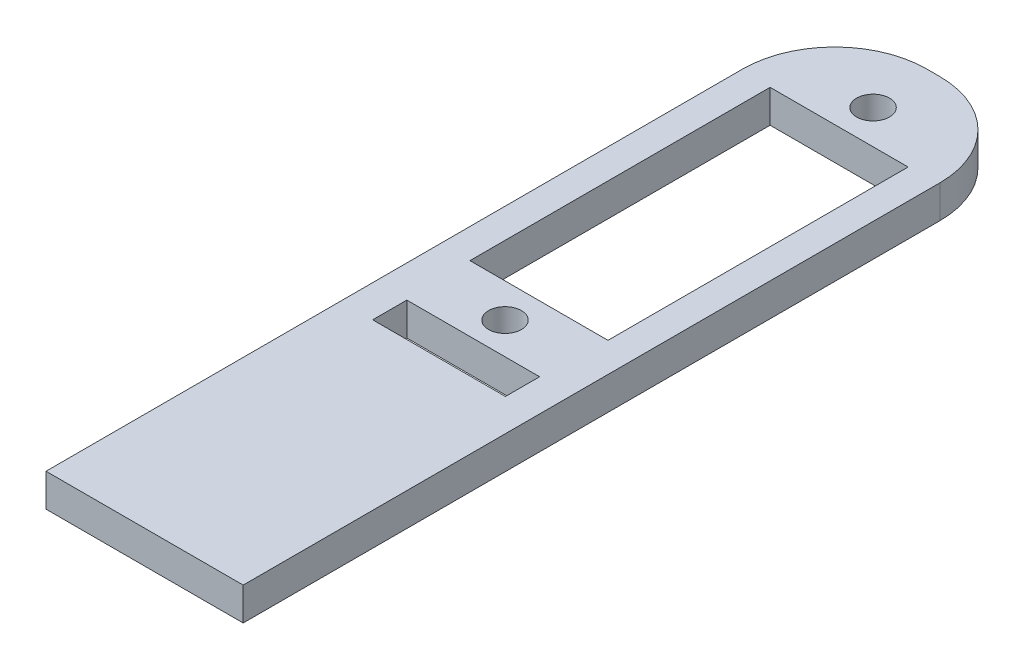
ISO-10303-21;
HEADER;
FILE_DESCRIPTION(('STEP AP214'),'2;1');
FILE_NAME('part.step','',(''),(''),'','','');
FILE_SCHEMA(('AUTOMOTIVE_DESIGN { 1 0 10303 214 1 1 1 1 }'));
ENDSEC;
DATA;
#1=APPLICATION_CONTEXT('core data for automotive mechanical design processes');
#2=APPLICATION_PROTOCOL_DEFINITION('international standard','automotive_design',2000,#1);
#3=PRODUCT_CONTEXT('',#1,'mechanical');
#4=PRODUCT('Part','Part','',(#3));
#5=PRODUCT_RELATED_PRODUCT_CATEGORY('part','',(#4));
#6=PRODUCT_DEFINITION_FORMATION('','',#4);
#7=PRODUCT_DEFINITION_CONTEXT('part definition',#1,'design');
#8=PRODUCT_DEFINITION('design','',#6,#7);
#9=PRODUCT_DEFINITION_SHAPE('','',#8);
#10=(LENGTH_UNIT() NAMED_UNIT(*) SI_UNIT(.MILLI.,.METRE.));
#11=(NAMED_UNIT(*) PLANE_ANGLE_UNIT() SI_UNIT($,.RADIAN.));
#12=(NAMED_UNIT(*) SI_UNIT($,.STERADIAN.) SOLID_ANGLE_UNIT());
#13=UNCERTAINTY_MEASURE_WITH_UNIT(LENGTH_MEASURE(1.E-05),#10,'distance_accuracy_value','');
#14=(GEOMETRIC_REPRESENTATION_CONTEXT(3) GLOBAL_UNCERTAINTY_ASSIGNED_CONTEXT((#13)) GLOBAL_UNIT_ASSIGNED_CONTEXT((#10,
#11,#12)) REPRESENTATION_CONTEXT('',''));
#15=CARTESIAN_POINT('',(0.,0.,0.));
#16=DIRECTION('',(0.,0.,1.));
#17=DIRECTION('',(1.,0.,0.));
#18=AXIS2_PLACEMENT_3D('',#15,#16,#17);
#19=CARTESIAN_POINT('',(-0.635,3.175,-29.21));
#20=DIRECTION('',(0.,1.,0.));
#21=DIRECTION('',(0.,0.,1.));
#22=AXIS2_PLACEMENT_3D('',#19,#20,#21);
#23=CYLINDRICAL_SURFACE('',#22,8.89);
#24=DIRECTION('',(0.,1.,0.));
#25=VECTOR('',#24,1.);
#26=CARTESIAN_POINT('',(-0.635,3.175,-38.1));
#27=LINE('',#26,#25);
#28=CARTESIAN_POINT('',(-0.635000000000004,0.,-38.1));
#29=VERTEX_POINT('',#28);
#30=CARTESIAN_POINT('',(-0.635000000000004,3.175,-38.1));
#31=VERTEX_POINT('',#30);
#32=EDGE_CURVE('E249',#29,#31,#27,.T.);
#33=ORIENTED_EDGE('',*,*,#32,.F.);
#34=CARTESIAN_POINT('',(-0.635,0.,-29.21));
#35=DIRECTION('',(0.,1.,0.));
#36=DIRECTION('',(0.,0.,1.));
#37=AXIS2_PLACEMENT_3D('',#34,#35,#36);
#38=CIRCLE('',#37,8.89);
#39=CARTESIAN_POINT('',(-9.525,0.,-29.21));
#40=VERTEX_POINT('',#39);
#41=EDGE_CURVE('E39',#40,#29,#38,.F.);
#42=ORIENTED_EDGE('',*,*,#41,.F.);
#43=DIRECTION('',(0.,1.,0.));
#44=VECTOR('',#43,1.);
#45=CARTESIAN_POINT('',(-9.525,3.175,-29.21));
#46=LINE('',#45,#44);
#47=CARTESIAN_POINT('',(-9.525,3.175,-29.21));
#48=VERTEX_POINT('',#47);
#49=EDGE_CURVE('E252',#48,#40,#46,.F.);
#50=ORIENTED_EDGE('',*,*,#49,.F.);
#51=CARTESIAN_POINT('',(-0.635,3.175,-29.21));
#52=DIRECTION('',(0.,1.,0.));
#53=DIRECTION('',(0.,0.,1.));
#54=AXIS2_PLACEMENT_3D('',#51,#52,#53);
#55=CIRCLE('',#54,8.89);
#56=EDGE_CURVE('E11',#31,#48,#55,.T.);
#57=ORIENTED_EDGE('',*,*,#56,.F.);
#58=EDGE_LOOP('',(#33,#42,#50,#57));
#59=FACE_BOUND('',#58,.T.);
#60=ADVANCED_FACE('F32',(#59),#23,.T.);
#61=CARTESIAN_POINT('',(0.635000000000004,3.175,-29.21));
#62=DIRECTION('',(0.,-1.,0.));
#63=DIRECTION('',(0.,0.,-1.));
#64=AXIS2_PLACEMENT_3D('',#61,#62,#63);
#65=CYLINDRICAL_SURFACE('',#64,8.89);
#66=DIRECTION('',(0.,-1.,0.));
#67=VECTOR('',#66,1.);
#68=CARTESIAN_POINT('',(0.635000000000004,3.175,-38.1));
#69=LINE('',#68,#67);
#70=CARTESIAN_POINT('',(0.635,3.175,-38.1));
#71=VERTEX_POINT('',#70);
#72=CARTESIAN_POINT('',(0.635,0.,-38.1));
#73=VERTEX_POINT('',#72);
#74=EDGE_CURVE('E239',#71,#73,#69,.T.);
#75=ORIENTED_EDGE('',*,*,#74,.F.);
#76=CARTESIAN_POINT('',(0.635000000000004,3.175,-29.21));
#77=DIRECTION('',(0.,1.,0.));
#78=DIRECTION('',(0.,0.,1.));
#79=AXIS2_PLACEMENT_3D('',#76,#77,#78);
#80=CIRCLE('',#79,8.89);
#81=CARTESIAN_POINT('',(9.525,3.175,-29.21));
#82=VERTEX_POINT('',#81);
#83=EDGE_CURVE('E245',#82,#71,#80,.T.);
#84=ORIENTED_EDGE('',*,*,#83,.F.);
#85=DIRECTION('',(0.,-1.,0.));
#86=VECTOR('',#85,1.);
#87=CARTESIAN_POINT('',(9.525,3.175,-29.21));
#88=LINE('',#87,#86);
#89=CARTESIAN_POINT('',(9.525,0.,-29.21));
#90=VERTEX_POINT('',#89);
#91=EDGE_CURVE('E242',#90,#82,#88,.F.);
#92=ORIENTED_EDGE('',*,*,#91,.F.);
#93=CARTESIAN_POINT('',(0.635000000000004,0.,-29.21));
#94=DIRECTION('',(0.,1.,0.));
#95=DIRECTION('',(0.,0.,1.));
#96=AXIS2_PLACEMENT_3D('',#93,#94,#95);
#97=CIRCLE('',#96,8.89);
#98=EDGE_CURVE('E247',#73,#90,#97,.F.);
#99=ORIENTED_EDGE('',*,*,#98,.F.);
#100=EDGE_LOOP('',(#75,#84,#92,#99));
#101=FACE_BOUND('',#100,.T.);
#102=ADVANCED_FACE('F264',(#101),#65,.T.);
#103=CARTESIAN_POINT('',(0.,3.175,0.));
#104=DIRECTION('',(0.,1.,0.));
#105=DIRECTION('',(0.,0.,1.));
#106=AXIS2_PLACEMENT_3D('',#103,#104,#105);
#107=PLANE('',#106);
#108=CARTESIAN_POINT('',(0.,3.175,3.28));
#109=DIRECTION('',(0.,1.,0.));
#110=DIRECTION('',(0.,0.,-1.));
#111=AXIS2_PLACEMENT_3D('',#108,#109,#110);
#112=CIRCLE('',#111,1.5875);
#113=CARTESIAN_POINT('',(0.,3.175,1.6925));
#114=VERTEX_POINT('',#113);
#115=EDGE_CURVE('E172',#114,#114,#112,.T.);
#116=ORIENTED_EDGE('',*,*,#115,.F.);
#117=EDGE_LOOP('',(#116));
#118=FACE_BOUND('',#117,.T.);
#119=DIRECTION('',(1.,0.,0.));
#120=VECTOR('',#119,1.);
#121=CARTESIAN_POINT('',(-6.6675,3.175,0.));
#122=LINE('',#121,#120);
#123=CARTESIAN_POINT('',(-6.6675,3.175,0.));
#124=VERTEX_POINT('',#123);
#125=CARTESIAN_POINT('',(6.6675,3.175,0.));
#126=VERTEX_POINT('',#125);
#127=EDGE_CURVE('E186',#124,#126,#122,.T.);
#128=ORIENTED_EDGE('',*,*,#127,.F.);
#129=DIRECTION('',(0.,0.,1.));
#130=VECTOR('',#129,1.);
#131=CARTESIAN_POINT('',(-6.6675,3.175,-29.));
#132=LINE('',#131,#130);
#133=CARTESIAN_POINT('',(-6.6675,3.175,-29.));
#134=VERTEX_POINT('',#133);
#135=EDGE_CURVE('E184',#134,#124,#132,.T.);
#136=ORIENTED_EDGE('',*,*,#135,.F.);
#137=DIRECTION('',(-1.,0.,0.));
#138=VECTOR('',#137,1.);
#139=CARTESIAN_POINT('',(-6.6675,3.175,-29.));
#140=LINE('',#139,#138);
#141=CARTESIAN_POINT('',(6.6675,3.175,-29.));
#142=VERTEX_POINT('',#141);
#143=EDGE_CURVE('E192',#142,#134,#140,.T.);
#144=ORIENTED_EDGE('',*,*,#143,.F.);
#145=DIRECTION('',(0.,0.,-1.));
#146=VECTOR('',#145,1.);
#147=CARTESIAN_POINT('',(6.6675,3.175,-29.));
#148=LINE('',#147,#146);
#149=EDGE_CURVE('E189',#126,#142,#148,.T.);
#150=ORIENTED_EDGE('',*,*,#149,.F.);
#151=EDGE_LOOP('',(#128,#136,#144,#150));
#152=FACE_BOUND('',#151,.T.);
#153=DIRECTION('',(-1.,0.,0.));
#154=VECTOR('',#153,1.);
#155=CARTESIAN_POINT('',(-9.525,3.175,-38.1));
#156=LINE('',#155,#154);
#157=EDGE_CURVE('E223',#71,#31,#156,.T.);
#158=ORIENTED_EDGE('',*,*,#157,.T.);
#159=ORIENTED_EDGE('',*,*,#56,.T.);
#160=DIRECTION('',(0.,0.,1.));
#161=VECTOR('',#160,1.);
#162=CARTESIAN_POINT('',(-9.525,3.175,-38.1));
#163=LINE('',#162,#161);
#164=CARTESIAN_POINT('',(-9.525,3.175,38.1));
#165=VERTEX_POINT('',#164);
#166=EDGE_CURVE('E215',#48,#165,#163,.T.);
#167=ORIENTED_EDGE('',*,*,#166,.T.);
#168=DIRECTION('',(1.,0.,0.));
#169=VECTOR('',#168,1.);
#170=CARTESIAN_POINT('',(-9.525,3.175,38.1));
#171=LINE('',#170,#169);
#172=CARTESIAN_POINT('',(9.52500000000001,3.175,38.1));
#173=VERTEX_POINT('',#172);
#174=EDGE_CURVE('E217',#165,#173,#171,.T.);
#175=ORIENTED_EDGE('',*,*,#174,.T.);
#176=DIRECTION('',(0.,0.,-1.));
#177=VECTOR('',#176,1.);
#178=CARTESIAN_POINT('',(9.525,3.175,-38.1));
#179=LINE('',#178,#177);
#180=EDGE_CURVE('E220',#173,#82,#179,.T.);
#181=ORIENTED_EDGE('',*,*,#180,.T.);
#182=ORIENTED_EDGE('',*,*,#83,.T.);
#183=EDGE_LOOP('',(#158,#159,#167,#175,#181,#182));
#184=FACE_BOUND('',#183,.T.);
#185=CARTESIAN_POINT('',(0.,3.175,-32.28));
#186=DIRECTION('',(0.,1.,0.));
#187=DIRECTION('',(0.,0.,1.));
#188=AXIS2_PLACEMENT_3D('',#185,#186,#187);
#189=CIRCLE('',#188,1.5875);
#190=CARTESIAN_POINT('',(0.,3.175,-30.6925));
#191=VERTEX_POINT('',#190);
#192=EDGE_CURVE('E178',#191,#191,#189,.T.);
#193=ORIENTED_EDGE('',*,*,#192,.F.);
#194=EDGE_LOOP('',(#193));
#195=FACE_BOUND('',#194,.T.);
#196=DIRECTION('',(1.,0.,0.));
#197=VECTOR('',#196,1.);
#198=CARTESIAN_POINT('',(-6.41350000000001,3.175,9.652));
#199=LINE('',#198,#197);
#200=CARTESIAN_POINT('',(-6.41350000000001,3.175,9.652));
#201=VERTEX_POINT('',#200);
#202=CARTESIAN_POINT('',(6.41349999999999,3.175,9.652));
#203=VERTEX_POINT('',#202);
#204=EDGE_CURVE('E140',#201,#203,#199,.T.);
#205=ORIENTED_EDGE('',*,*,#204,.F.);
#206=DIRECTION('',(0.,0.,1.));
#207=VECTOR('',#206,1.);
#208=CARTESIAN_POINT('',(-6.41349999999999,3.175,6.35));
#209=LINE('',#208,#207);
#210=CARTESIAN_POINT('',(-6.41349999999999,3.175,6.35));
#211=VERTEX_POINT('',#210);
#212=EDGE_CURVE('E130',#211,#201,#209,.T.);
#213=ORIENTED_EDGE('',*,*,#212,.F.);
#214=DIRECTION('',(-1.,0.,0.));
#215=VECTOR('',#214,1.);
#216=CARTESIAN_POINT('',(-6.41349999999999,3.175,6.35));
#217=LINE('',#216,#215);
#218=CARTESIAN_POINT('',(6.41349999999999,3.175,6.35));
#219=VERTEX_POINT('',#218);
#220=EDGE_CURVE('E156',#219,#211,#217,.T.);
#221=ORIENTED_EDGE('',*,*,#220,.F.);
#222=DIRECTION('',(0.,0.,-1.));
#223=VECTOR('',#222,1.);
#224=CARTESIAN_POINT('',(6.41349999999999,3.175,6.35));
#225=LINE('',#224,#223);
#226=EDGE_CURVE('E154',#203,#219,#225,.T.);
#227=ORIENTED_EDGE('',*,*,#226,.F.);
#228=EDGE_LOOP('',(#205,#213,#221,#227));
#229=FACE_BOUND('',#228,.T.);
#230=ADVANCED_FACE('F152',(#118,#152,#184,#195,#229),#107,.T.);
#231=CARTESIAN_POINT('',(0.,0.,0.));
#232=DIRECTION('',(0.,1.,0.));
#233=DIRECTION('',(0.,0.,1.));
#234=AXIS2_PLACEMENT_3D('',#231,#232,#233);
#235=PLANE('',#234);
#236=CARTESIAN_POINT('',(0.,0.,3.28));
#237=DIRECTION('',(0.,1.,0.));
#238=DIRECTION('',(0.,0.,-1.));
#239=AXIS2_PLACEMENT_3D('',#236,#237,#238);
#240=CIRCLE('',#239,1.5875);
#241=CARTESIAN_POINT('',(0.,0.,1.6925));
#242=VERTEX_POINT('',#241);
#243=EDGE_CURVE('E148',#242,#242,#240,.T.);
#244=ORIENTED_EDGE('',*,*,#243,.T.);
#245=EDGE_LOOP('',(#244));
#246=FACE_BOUND('',#245,.T.);
#247=DIRECTION('',(0.,0.,1.));
#248=VECTOR('',#247,1.);
#249=CARTESIAN_POINT('',(-6.6675,0.,-29.));
#250=LINE('',#249,#248);
#251=CARTESIAN_POINT('',(-6.6675,0.,-29.));
#252=VERTEX_POINT('',#251);
#253=CARTESIAN_POINT('',(-6.6675,0.,0.));
#254=VERTEX_POINT('',#253);
#255=EDGE_CURVE('E181',#252,#254,#250,.T.);
#256=ORIENTED_EDGE('',*,*,#255,.T.);
#257=DIRECTION('',(1.,0.,0.));
#258=VECTOR('',#257,1.);
#259=CARTESIAN_POINT('',(-6.6675,0.,0.));
#260=LINE('',#259,#258);
#261=CARTESIAN_POINT('',(6.6675,0.,0.));
#262=VERTEX_POINT('',#261);
#263=EDGE_CURVE('E197',#254,#262,#260,.T.);
#264=ORIENTED_EDGE('',*,*,#263,.T.);
#265=DIRECTION('',(0.,0.,-1.));
#266=VECTOR('',#265,1.);
#267=CARTESIAN_POINT('',(6.6675,0.,-29.));
#268=LINE('',#267,#266);
#269=CARTESIAN_POINT('',(6.6675,0.,-29.));
#270=VERTEX_POINT('',#269);
#271=EDGE_CURVE('E200',#262,#270,#268,.T.);
#272=ORIENTED_EDGE('',*,*,#271,.T.);
#273=DIRECTION('',(-1.,0.,0.));
#274=VECTOR('',#273,1.);
#275=CARTESIAN_POINT('',(-6.6675,0.,-29.));
#276=LINE('',#275,#274);
#277=EDGE_CURVE('E187',#270,#252,#276,.T.);
#278=ORIENTED_EDGE('',*,*,#277,.T.);
#279=EDGE_LOOP('',(#256,#264,#272,#278));
#280=FACE_BOUND('',#279,.T.);
#281=DIRECTION('',(0.,0.,1.));
#282=VECTOR('',#281,1.);
#283=CARTESIAN_POINT('',(-9.525,0.,-38.1));
#284=LINE('',#283,#282);
#285=CARTESIAN_POINT('',(-9.525,0.,38.1));
#286=VERTEX_POINT('',#285);
#287=EDGE_CURVE('E214',#40,#286,#284,.T.);
#288=ORIENTED_EDGE('',*,*,#287,.F.);
#289=ORIENTED_EDGE('',*,*,#41,.T.);
#290=DIRECTION('',(-1.,0.,0.));
#291=VECTOR('',#290,1.);
#292=CARTESIAN_POINT('',(-9.525,0.,-38.1));
#293=LINE('',#292,#291);
#294=EDGE_CURVE('E218',#73,#29,#293,.T.);
#295=ORIENTED_EDGE('',*,*,#294,.F.);
#296=ORIENTED_EDGE('',*,*,#98,.T.);
#297=DIRECTION('',(0.,0.,-1.));
#298=VECTOR('',#297,1.);
#299=CARTESIAN_POINT('',(9.525,0.,-38.1));
#300=LINE('',#299,#298);
#301=CARTESIAN_POINT('',(9.52500000000001,0.,38.1));
#302=VERTEX_POINT('',#301);
#303=EDGE_CURVE('E229',#302,#90,#300,.T.);
#304=ORIENTED_EDGE('',*,*,#303,.F.);
#305=DIRECTION('',(1.,0.,0.));
#306=VECTOR('',#305,1.);
#307=CARTESIAN_POINT('',(-9.525,0.,38.1));
#308=LINE('',#307,#306);
#309=EDGE_CURVE('E227',#286,#302,#308,.T.);
#310=ORIENTED_EDGE('',*,*,#309,.F.);
#311=EDGE_LOOP('',(#288,#289,#295,#296,#304,#310));
#312=FACE_BOUND('',#311,.T.);
#313=CARTESIAN_POINT('',(0.,0.,-32.28));
#314=DIRECTION('',(0.,1.,0.));
#315=DIRECTION('',(0.,0.,1.));
#316=AXIS2_PLACEMENT_3D('',#313,#314,#315);
#317=CIRCLE('',#316,1.5875);
#318=CARTESIAN_POINT('',(0.,0.,-30.6925));
#319=VERTEX_POINT('',#318);
#320=EDGE_CURVE('E175',#319,#319,#317,.T.);
#321=ORIENTED_EDGE('',*,*,#320,.T.);
#322=EDGE_LOOP('',(#321));
#323=FACE_BOUND('',#322,.T.);
#324=DIRECTION('',(0.,0.,1.));
#325=VECTOR('',#324,1.);
#326=CARTESIAN_POINT('',(-6.41349999999999,0.,6.35));
#327=LINE('',#326,#325);
#328=CARTESIAN_POINT('',(-6.41349999999999,0.,6.35));
#329=VERTEX_POINT('',#328);
#330=CARTESIAN_POINT('',(-6.41350000000001,0.,9.652));
#331=VERTEX_POINT('',#330);
#332=EDGE_CURVE('E160',#329,#331,#327,.T.);
#333=ORIENTED_EDGE('',*,*,#332,.T.);
#334=DIRECTION('',(1.,0.,0.));
#335=VECTOR('',#334,1.);
#336=CARTESIAN_POINT('',(-6.41350000000001,0.,9.652));
#337=LINE('',#336,#335);
#338=CARTESIAN_POINT('',(6.41349999999999,0.,9.652));
#339=VERTEX_POINT('',#338);
#340=EDGE_CURVE('E147',#331,#339,#337,.T.);
#341=ORIENTED_EDGE('',*,*,#340,.T.);
#342=DIRECTION('',(0.,0.,-1.));
#343=VECTOR('',#342,1.);
#344=CARTESIAN_POINT('',(6.41349999999999,0.,6.35));
#345=LINE('',#344,#343);
#346=CARTESIAN_POINT('',(6.41349999999999,0.,6.35));
#347=VERTEX_POINT('',#346);
#348=EDGE_CURVE('E163',#339,#347,#345,.T.);
#349=ORIENTED_EDGE('',*,*,#348,.T.);
#350=DIRECTION('',(-1.,0.,0.));
#351=VECTOR('',#350,1.);
#352=CARTESIAN_POINT('',(-6.41349999999999,0.,6.35));
#353=LINE('',#352,#351);
#354=EDGE_CURVE('E141',#347,#329,#353,.T.);
#355=ORIENTED_EDGE('',*,*,#354,.T.);
#356=EDGE_LOOP('',(#333,#341,#349,#355));
#357=FACE_BOUND('',#356,.T.);
#358=ADVANCED_FACE('F256',(#246,#280,#312,#323,#357),#235,.F.);
#359=CARTESIAN_POINT('',(-9.525,3.175,-38.1));
#360=DIRECTION('',(1.,0.,0.));
#361=DIRECTION('',(0.,0.,-1.));
#362=AXIS2_PLACEMENT_3D('',#359,#360,#361);
#363=PLANE('',#362);
#364=ORIENTED_EDGE('',*,*,#166,.F.);
#365=ORIENTED_EDGE('',*,*,#49,.T.);
#366=ORIENTED_EDGE('',*,*,#287,.T.);
#367=DIRECTION('',(0.,-1.,0.));
#368=VECTOR('',#367,1.);
#369=CARTESIAN_POINT('',(-9.525,3.175,38.1));
#370=LINE('',#369,#368);
#371=EDGE_CURVE('E236',#165,#286,#370,.T.);
#372=ORIENTED_EDGE('',*,*,#371,.F.);
#373=EDGE_LOOP('',(#364,#365,#366,#372));
#374=FACE_BOUND('',#373,.T.);
#375=ADVANCED_FACE('F277',(#374),#363,.F.);
#376=CARTESIAN_POINT('',(-9.525,3.175,38.1));
#377=DIRECTION('',(0.,0.,-1.));
#378=DIRECTION('',(-1.,0.,0.));
#379=AXIS2_PLACEMENT_3D('',#376,#377,#378);
#380=PLANE('',#379);
#381=ORIENTED_EDGE('',*,*,#309,.T.);
#382=DIRECTION('',(0.,-1.,0.));
#383=VECTOR('',#382,1.);
#384=CARTESIAN_POINT('',(9.52500000000001,3.175,38.1));
#385=LINE('',#384,#383);
#386=EDGE_CURVE('E225',#173,#302,#385,.T.);
#387=ORIENTED_EDGE('',*,*,#386,.F.);
#388=ORIENTED_EDGE('',*,*,#174,.F.);
#389=ORIENTED_EDGE('',*,*,#371,.T.);
#390=EDGE_LOOP('',(#381,#387,#388,#389));
#391=FACE_BOUND('',#390,.T.);
#392=ADVANCED_FACE('F273',(#391),#380,.F.);
#393=CARTESIAN_POINT('',(9.525,3.175,-38.1));
#394=DIRECTION('',(-1.,0.,0.));
#395=DIRECTION('',(0.,0.,1.));
#396=AXIS2_PLACEMENT_3D('',#393,#394,#395);
#397=PLANE('',#396);
#398=ORIENTED_EDGE('',*,*,#303,.T.);
#399=ORIENTED_EDGE('',*,*,#91,.T.);
#400=ORIENTED_EDGE('',*,*,#180,.F.);
#401=ORIENTED_EDGE('',*,*,#386,.T.);
#402=EDGE_LOOP('',(#398,#399,#400,#401));
#403=FACE_BOUND('',#402,.T.);
#404=ADVANCED_FACE('F268',(#403),#397,.F.);
#405=CARTESIAN_POINT('',(-9.525,3.175,-38.1));
#406=DIRECTION('',(0.,0.,1.));
#407=DIRECTION('',(1.,0.,0.));
#408=AXIS2_PLACEMENT_3D('',#405,#406,#407);
#409=PLANE('',#408);
#410=ORIENTED_EDGE('',*,*,#294,.T.);
#411=ORIENTED_EDGE('',*,*,#32,.T.);
#412=ORIENTED_EDGE('',*,*,#157,.F.);
#413=ORIENTED_EDGE('',*,*,#74,.T.);
#414=EDGE_LOOP('',(#410,#411,#412,#413));
#415=FACE_BOUND('',#414,.T.);
#416=ADVANCED_FACE('F261',(#415),#409,.F.);
#417=CARTESIAN_POINT('',(-6.6675,3.175,-29.));
#418=DIRECTION('',(1.,0.,0.));
#419=DIRECTION('',(0.,0.,-1.));
#420=AXIS2_PLACEMENT_3D('',#417,#418,#419);
#421=PLANE('',#420);
#422=ORIENTED_EDGE('',*,*,#255,.F.);
#423=DIRECTION('',(0.,-1.,0.));
#424=VECTOR('',#423,1.);
#425=CARTESIAN_POINT('',(-6.6675,3.175,-29.));
#426=LINE('',#425,#424);
#427=EDGE_CURVE('E194',#134,#252,#426,.T.);
#428=ORIENTED_EDGE('',*,*,#427,.F.);
#429=ORIENTED_EDGE('',*,*,#135,.T.);
#430=DIRECTION('',(0.,-1.,0.));
#431=VECTOR('',#430,1.);
#432=CARTESIAN_POINT('',(-6.6675,3.175,0.));
#433=LINE('',#432,#431);
#434=EDGE_CURVE('E211',#124,#254,#433,.T.);
#435=ORIENTED_EDGE('',*,*,#434,.T.);
#436=EDGE_LOOP('',(#422,#428,#429,#435));
#437=FACE_BOUND('',#436,.T.);
#438=ADVANCED_FACE('F323',(#437),#421,.T.);
#439=CARTESIAN_POINT('',(-6.6675,3.175,0.));
#440=DIRECTION('',(0.,0.,-1.));
#441=DIRECTION('',(-1.,0.,0.));
#442=AXIS2_PLACEMENT_3D('',#439,#440,#441);
#443=PLANE('',#442);
#444=ORIENTED_EDGE('',*,*,#263,.F.);
#445=ORIENTED_EDGE('',*,*,#434,.F.);
#446=ORIENTED_EDGE('',*,*,#127,.T.);
#447=DIRECTION('',(0.,-1.,0.));
#448=VECTOR('',#447,1.);
#449=CARTESIAN_POINT('',(6.6675,3.175,0.));
#450=LINE('',#449,#448);
#451=EDGE_CURVE('E209',#126,#262,#450,.T.);
#452=ORIENTED_EDGE('',*,*,#451,.T.);
#453=EDGE_LOOP('',(#444,#445,#446,#452));
#454=FACE_BOUND('',#453,.T.);
#455=ADVANCED_FACE('F327',(#454),#443,.T.);
#456=CARTESIAN_POINT('',(6.6675,3.175,-29.));
#457=DIRECTION('',(-1.,0.,0.));
#458=DIRECTION('',(0.,0.,1.));
#459=AXIS2_PLACEMENT_3D('',#456,#457,#458);
#460=PLANE('',#459);
#461=ORIENTED_EDGE('',*,*,#271,.F.);
#462=ORIENTED_EDGE('',*,*,#451,.F.);
#463=ORIENTED_EDGE('',*,*,#149,.T.);
#464=DIRECTION('',(0.,-1.,0.));
#465=VECTOR('',#464,1.);
#466=CARTESIAN_POINT('',(6.6675,3.175,-29.));
#467=LINE('',#466,#465);
#468=EDGE_CURVE('E207',#142,#270,#467,.T.);
#469=ORIENTED_EDGE('',*,*,#468,.T.);
#470=EDGE_LOOP('',(#461,#462,#463,#469));
#471=FACE_BOUND('',#470,.T.);
#472=ADVANCED_FACE('F331',(#471),#460,.T.);
#473=CARTESIAN_POINT('',(-6.6675,3.175,-29.));
#474=DIRECTION('',(0.,0.,1.));
#475=DIRECTION('',(1.,0.,0.));
#476=AXIS2_PLACEMENT_3D('',#473,#474,#475);
#477=PLANE('',#476);
#478=ORIENTED_EDGE('',*,*,#277,.F.);
#479=ORIENTED_EDGE('',*,*,#468,.F.);
#480=ORIENTED_EDGE('',*,*,#143,.T.);
#481=ORIENTED_EDGE('',*,*,#427,.T.);
#482=EDGE_LOOP('',(#478,#479,#480,#481));
#483=FACE_BOUND('',#482,.T.);
#484=ADVANCED_FACE('F288',(#483),#477,.T.);
#485=CARTESIAN_POINT('',(0.,3.175,-32.28));
#486=DIRECTION('',(0.,-1.,0.));
#487=DIRECTION('',(0.,0.,-1.));
#488=AXIS2_PLACEMENT_3D('',#485,#486,#487);
#489=CYLINDRICAL_SURFACE('',#488,1.5875);
#490=ORIENTED_EDGE('',*,*,#192,.T.);
#491=EDGE_LOOP('',(#490));
#492=FACE_BOUND('',#491,.T.);
#493=ORIENTED_EDGE('',*,*,#320,.F.);
#494=EDGE_LOOP('',(#493));
#495=FACE_BOUND('',#494,.T.);
#496=ADVANCED_FACE('F284',(#492,#495),#489,.F.);
#497=CARTESIAN_POINT('',(0.,3.175,3.28));
#498=DIRECTION('',(0.,-1.,0.));
#499=DIRECTION('',(0.,0.,-1.));
#500=AXIS2_PLACEMENT_3D('',#497,#498,#499);
#501=CYLINDRICAL_SURFACE('',#500,1.5875);
#502=ORIENTED_EDGE('',*,*,#115,.T.);
#503=EDGE_LOOP('',(#502));
#504=FACE_BOUND('',#503,.T.);
#505=ORIENTED_EDGE('',*,*,#243,.F.);
#506=EDGE_LOOP('',(#505));
#507=FACE_BOUND('',#506,.T.);
#508=ADVANCED_FACE('F287',(#504,#507),#501,.F.);
#509=CARTESIAN_POINT('',(-6.41349999999999,3.175,6.35));
#510=DIRECTION('',(1.,0.,0.));
#511=DIRECTION('',(0.,0.,-1.));
#512=AXIS2_PLACEMENT_3D('',#509,#510,#511);
#513=PLANE('',#512);
#514=ORIENTED_EDGE('',*,*,#332,.F.);
#515=DIRECTION('',(0.,-1.,0.));
#516=VECTOR('',#515,1.);
#517=CARTESIAN_POINT('',(-6.41349999999999,3.175,6.35));
#518=LINE('',#517,#516);
#519=EDGE_CURVE('E136',#211,#329,#518,.T.);
#520=ORIENTED_EDGE('',*,*,#519,.F.);
#521=ORIENTED_EDGE('',*,*,#212,.T.);
#522=DIRECTION('',(0.,-1.,0.));
#523=VECTOR('',#522,1.);
#524=CARTESIAN_POINT('',(-6.41350000000001,3.175,9.652));
#525=LINE('',#524,#523);
#526=EDGE_CURVE('E133',#201,#331,#525,.T.);
#527=ORIENTED_EDGE('',*,*,#526,.T.);
#528=EDGE_LOOP('',(#514,#520,#521,#527));
#529=FACE_BOUND('',#528,.T.);
#530=ADVANCED_FACE('F132',(#529),#513,.T.);
#531=CARTESIAN_POINT('',(-6.41350000000001,3.175,9.652));
#532=DIRECTION('',(0.,0.,-1.));
#533=DIRECTION('',(-1.,0.,0.));
#534=AXIS2_PLACEMENT_3D('',#531,#532,#533);
#535=PLANE('',#534);
#536=ORIENTED_EDGE('',*,*,#340,.F.);
#537=ORIENTED_EDGE('',*,*,#526,.F.);
#538=ORIENTED_EDGE('',*,*,#204,.T.);
#539=DIRECTION('',(0.,-1.,0.));
#540=VECTOR('',#539,1.);
#541=CARTESIAN_POINT('',(6.41349999999999,3.175,9.652));
#542=LINE('',#541,#540);
#543=EDGE_CURVE('E149',#203,#339,#542,.T.);
#544=ORIENTED_EDGE('',*,*,#543,.T.);
#545=EDGE_LOOP('',(#536,#537,#538,#544));
#546=FACE_BOUND('',#545,.T.);
#547=ADVANCED_FACE('F144',(#546),#535,.T.);
#548=CARTESIAN_POINT('',(6.41349999999999,3.175,6.35));
#549=DIRECTION('',(-1.,0.,0.));
#550=DIRECTION('',(0.,0.,1.));
#551=AXIS2_PLACEMENT_3D('',#548,#549,#550);
#552=PLANE('',#551);
#553=ORIENTED_EDGE('',*,*,#348,.F.);
#554=ORIENTED_EDGE('',*,*,#543,.F.);
#555=ORIENTED_EDGE('',*,*,#226,.T.);
#556=DIRECTION('',(0.,-1.,0.));
#557=VECTOR('',#556,1.);
#558=CARTESIAN_POINT('',(6.41349999999999,3.175,6.35));
#559=LINE('',#558,#557);
#560=EDGE_CURVE('E169',#219,#347,#559,.T.);
#561=ORIENTED_EDGE('',*,*,#560,.T.);
#562=EDGE_LOOP('',(#553,#554,#555,#561));
#563=FACE_BOUND('',#562,.T.);
#564=ADVANCED_FACE('F300',(#563),#552,.T.);
#565=CARTESIAN_POINT('',(-6.41349999999999,3.175,6.35));
#566=DIRECTION('',(0.,0.,1.));
#567=DIRECTION('',(1.,0.,0.));
#568=AXIS2_PLACEMENT_3D('',#565,#566,#567);
#569=PLANE('',#568);
#570=ORIENTED_EDGE('',*,*,#354,.F.);
#571=ORIENTED_EDGE('',*,*,#560,.F.);
#572=ORIENTED_EDGE('',*,*,#220,.T.);
#573=ORIENTED_EDGE('',*,*,#519,.T.);
#574=EDGE_LOOP('',(#570,#571,#572,#573));
#575=FACE_BOUND('',#574,.T.);
#576=ADVANCED_FACE('F297',(#575),#569,.T.);
#577=CLOSED_SHELL('',(#60,#102,#230,#358,#375,#392,#404,#416,#438,#455,#472,#484,#496,#508,#530,
#547,#564,#576));
#578=MANIFOLD_SOLID_BREP('B2',#577);
#579=ADVANCED_BREP_SHAPE_REPRESENTATION('',(#18,#578),#14);
#580=SHAPE_DEFINITION_REPRESENTATION(#9,#579);
ENDSEC;
END-ISO-10303-21;
